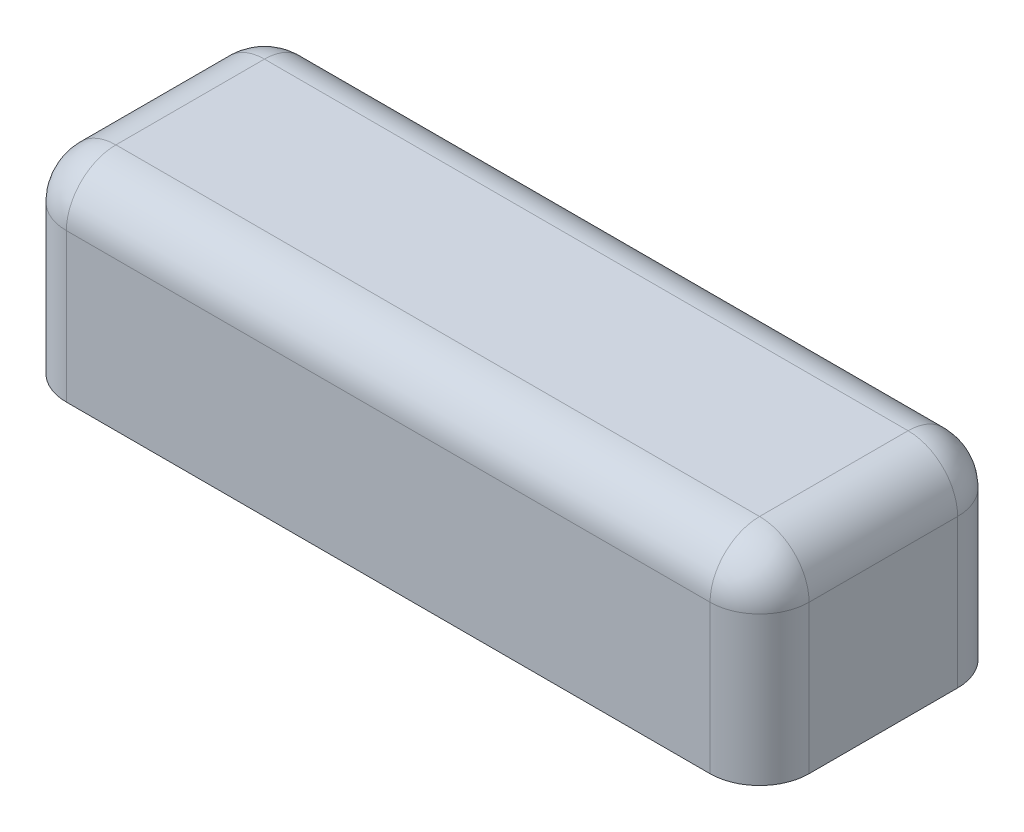
ISO-10303-21;
HEADER;
FILE_DESCRIPTION(('STEP AP214'),'2;1');
FILE_NAME('part.step','',(''),(''),'','','');
FILE_SCHEMA(('AUTOMOTIVE_DESIGN { 1 0 10303 214 1 1 1 1 }'));
ENDSEC;
DATA;
#1=APPLICATION_CONTEXT('core data for automotive mechanical design processes');
#2=APPLICATION_PROTOCOL_DEFINITION('international standard','automotive_design',2000,#1);
#3=PRODUCT_CONTEXT('',#1,'mechanical');
#4=PRODUCT('Part','Part','',(#3));
#5=PRODUCT_RELATED_PRODUCT_CATEGORY('part','',(#4));
#6=PRODUCT_DEFINITION_FORMATION('','',#4);
#7=PRODUCT_DEFINITION_CONTEXT('part definition',#1,'design');
#8=PRODUCT_DEFINITION('design','',#6,#7);
#9=PRODUCT_DEFINITION_SHAPE('','',#8);
#10=(LENGTH_UNIT() NAMED_UNIT(*) SI_UNIT(.MILLI.,.METRE.));
#11=(NAMED_UNIT(*) PLANE_ANGLE_UNIT() SI_UNIT($,.RADIAN.));
#12=(NAMED_UNIT(*) SI_UNIT($,.STERADIAN.) SOLID_ANGLE_UNIT());
#13=UNCERTAINTY_MEASURE_WITH_UNIT(LENGTH_MEASURE(1.E-05),#10,'distance_accuracy_value','');
#14=(GEOMETRIC_REPRESENTATION_CONTEXT(3) GLOBAL_UNCERTAINTY_ASSIGNED_CONTEXT((#13)) GLOBAL_UNIT_ASSIGNED_CONTEXT((#10,
#11,#12)) REPRESENTATION_CONTEXT('',''));
#15=CARTESIAN_POINT('',(0.,0.,0.));
#16=DIRECTION('',(0.,0.,1.));
#17=DIRECTION('',(1.,0.,0.));
#18=AXIS2_PLACEMENT_3D('',#15,#16,#17);
#19=CARTESIAN_POINT('',(19.4027020138142,4.,50.8352955261232));
#20=DIRECTION('',(1.,0.,0.));
#21=DIRECTION('',(0.,0.,-1.));
#22=AXIS2_PLACEMENT_3D('',#19,#20,#21);
#23=PLANE('',#22);
#24=DIRECTION('',(0.,0.,1.));
#25=VECTOR('',#24,1.);
#26=CARTESIAN_POINT('',(19.4027020138142,3.,50.8352955261232));
#27=LINE('',#26,#25);
#28=CARTESIAN_POINT('',(19.4027020138142,3.,49.8352955261232));
#29=VERTEX_POINT('',#28);
#30=CARTESIAN_POINT('',(19.4027020138142,3.,46.8352955261232));
#31=VERTEX_POINT('',#30);
#32=EDGE_CURVE('E54',#29,#31,#27,.F.);
#33=ORIENTED_EDGE('',*,*,#32,.T.);
#34=DIRECTION('',(0.,-1.,0.));
#35=VECTOR('',#34,1.);
#36=CARTESIAN_POINT('',(19.4027020138142,4.,46.8352955261232));
#37=LINE('',#36,#35);
#38=CARTESIAN_POINT('',(19.4027020138142,0.,46.8352955261232));
#39=VERTEX_POINT('',#38);
#40=EDGE_CURVE('E11',#31,#39,#37,.T.);
#41=ORIENTED_EDGE('',*,*,#40,.T.);
#42=DIRECTION('',(0.,0.,1.));
#43=VECTOR('',#42,1.);
#44=CARTESIAN_POINT('',(19.4027020138142,0.,50.8352955261232));
#45=LINE('',#44,#43);
#46=CARTESIAN_POINT('',(19.4027020138142,0.,49.8352955261232));
#47=VERTEX_POINT('',#46);
#48=EDGE_CURVE('E203',#39,#47,#45,.T.);
#49=ORIENTED_EDGE('',*,*,#48,.T.);
#50=DIRECTION('',(0.,-1.,0.));
#51=VECTOR('',#50,1.);
#52=CARTESIAN_POINT('',(19.4027020138142,4.,49.8352955261232));
#53=LINE('',#52,#51);
#54=EDGE_CURVE('E47',#47,#29,#53,.F.);
#55=ORIENTED_EDGE('',*,*,#54,.T.);
#56=EDGE_LOOP('',(#33,#41,#49,#55));
#57=FACE_BOUND('',#56,.T.);
#58=ADVANCED_FACE('F38',(#57),#23,.F.);
#59=CARTESIAN_POINT('',(34.4027020138142,4.,50.8352955261232));
#60=DIRECTION('',(0.,0.,-1.));
#61=DIRECTION('',(-1.,0.,0.));
#62=AXIS2_PLACEMENT_3D('',#59,#60,#61);
#63=PLANE('',#62);
#64=DIRECTION('',(1.,0.,0.));
#65=VECTOR('',#64,1.);
#66=CARTESIAN_POINT('',(34.4027020138142,0.,50.8352955261232));
#67=LINE('',#66,#65);
#68=CARTESIAN_POINT('',(20.4027020138142,0.,50.8352955261232));
#69=VERTEX_POINT('',#68);
#70=CARTESIAN_POINT('',(33.4027020138142,0.,50.8352955261232));
#71=VERTEX_POINT('',#70);
#72=EDGE_CURVE('E205',#69,#71,#67,.T.);
#73=ORIENTED_EDGE('',*,*,#72,.T.);
#74=DIRECTION('',(0.,-1.,0.));
#75=VECTOR('',#74,1.);
#76=CARTESIAN_POINT('',(33.4027020138142,4.,50.8352955261232));
#77=LINE('',#76,#75);
#78=CARTESIAN_POINT('',(33.4027020138142,3.,50.8352955261232));
#79=VERTEX_POINT('',#78);
#80=EDGE_CURVE('E177',#71,#79,#77,.F.);
#81=ORIENTED_EDGE('',*,*,#80,.T.);
#82=DIRECTION('',(1.,0.,0.));
#83=VECTOR('',#82,1.);
#84=CARTESIAN_POINT('',(34.4027020138142,3.,50.8352955261232));
#85=LINE('',#84,#83);
#86=CARTESIAN_POINT('',(20.4027020138142,3.,50.8352955261232));
#87=VERTEX_POINT('',#86);
#88=EDGE_CURVE('E173',#79,#87,#85,.F.);
#89=ORIENTED_EDGE('',*,*,#88,.T.);
#90=DIRECTION('',(0.,-1.,0.));
#91=VECTOR('',#90,1.);
#92=CARTESIAN_POINT('',(20.4027020138142,4.,50.8352955261232));
#93=LINE('',#92,#91);
#94=EDGE_CURVE('E175',#87,#69,#93,.T.);
#95=ORIENTED_EDGE('',*,*,#94,.T.);
#96=EDGE_LOOP('',(#73,#81,#89,#95));
#97=FACE_BOUND('',#96,.T.);
#98=ADVANCED_FACE('F245',(#97),#63,.F.);
#99=CARTESIAN_POINT('',(34.4027020138142,4.,45.8352955261232));
#100=DIRECTION('',(-1.,0.,0.));
#101=DIRECTION('',(0.,0.,1.));
#102=AXIS2_PLACEMENT_3D('',#99,#100,#101);
#103=PLANE('',#102);
#104=DIRECTION('',(0.,0.,-1.));
#105=VECTOR('',#104,1.);
#106=CARTESIAN_POINT('',(34.4027020138142,0.,45.8352955261232));
#107=LINE('',#106,#105);
#108=CARTESIAN_POINT('',(34.4027020138142,0.,49.8352955261232));
#109=VERTEX_POINT('',#108);
#110=CARTESIAN_POINT('',(34.4027020138142,0.,46.8352955261232));
#111=VERTEX_POINT('',#110);
#112=EDGE_CURVE('E209',#109,#111,#107,.T.);
#113=ORIENTED_EDGE('',*,*,#112,.T.);
#114=DIRECTION('',(0.,-1.,0.));
#115=VECTOR('',#114,1.);
#116=CARTESIAN_POINT('',(34.4027020138142,4.,46.8352955261232));
#117=LINE('',#116,#115);
#118=CARTESIAN_POINT('',(34.4027020138142,3.,46.8352955261232));
#119=VERTEX_POINT('',#118);
#120=EDGE_CURVE('E157',#111,#119,#117,.F.);
#121=ORIENTED_EDGE('',*,*,#120,.T.);
#122=DIRECTION('',(0.,0.,-1.));
#123=VECTOR('',#122,1.);
#124=CARTESIAN_POINT('',(34.4027020138142,3.,45.8352955261232));
#125=LINE('',#124,#123);
#126=CARTESIAN_POINT('',(34.4027020138142,3.,49.8352955261232));
#127=VERTEX_POINT('',#126);
#128=EDGE_CURVE('E121',#119,#127,#125,.F.);
#129=ORIENTED_EDGE('',*,*,#128,.T.);
#130=DIRECTION('',(0.,-1.,0.));
#131=VECTOR('',#130,1.);
#132=CARTESIAN_POINT('',(34.4027020138142,4.,49.8352955261232));
#133=LINE('',#132,#131);
#134=EDGE_CURVE('E151',#127,#109,#133,.T.);
#135=ORIENTED_EDGE('',*,*,#134,.T.);
#136=EDGE_LOOP('',(#113,#121,#129,#135));
#137=FACE_BOUND('',#136,.T.);
#138=ADVANCED_FACE('F236',(#137),#103,.F.);
#139=CARTESIAN_POINT('',(19.4027020138142,4.,45.8352955261232));
#140=DIRECTION('',(0.,0.,1.));
#141=DIRECTION('',(1.,0.,0.));
#142=AXIS2_PLACEMENT_3D('',#139,#140,#141);
#143=PLANE('',#142);
#144=DIRECTION('',(-1.,0.,0.));
#145=VECTOR('',#144,1.);
#146=CARTESIAN_POINT('',(19.4027020138142,3.,45.8352955261232));
#147=LINE('',#146,#145);
#148=CARTESIAN_POINT('',(20.4027020138142,3.,45.8352955261232));
#149=VERTEX_POINT('',#148);
#150=CARTESIAN_POINT('',(33.4027020138142,3.,45.8352955261232));
#151=VERTEX_POINT('',#150);
#152=EDGE_CURVE('E159',#149,#151,#147,.F.);
#153=ORIENTED_EDGE('',*,*,#152,.T.);
#154=DIRECTION('',(0.,-1.,0.));
#155=VECTOR('',#154,1.);
#156=CARTESIAN_POINT('',(33.4027020138142,4.,45.8352955261232));
#157=LINE('',#156,#155);
#158=CARTESIAN_POINT('',(33.4027020138142,0.,45.8352955261232));
#159=VERTEX_POINT('',#158);
#160=EDGE_CURVE('E163',#151,#159,#157,.T.);
#161=ORIENTED_EDGE('',*,*,#160,.T.);
#162=DIRECTION('',(-1.,0.,0.));
#163=VECTOR('',#162,1.);
#164=CARTESIAN_POINT('',(19.4027020138142,0.,45.8352955261232));
#165=LINE('',#164,#163);
#166=CARTESIAN_POINT('',(20.4027020138142,0.,45.8352955261232));
#167=VERTEX_POINT('',#166);
#168=EDGE_CURVE('E144',#159,#167,#165,.T.);
#169=ORIENTED_EDGE('',*,*,#168,.T.);
#170=DIRECTION('',(0.,-1.,0.));
#171=VECTOR('',#170,1.);
#172=CARTESIAN_POINT('',(20.4027020138142,4.,45.8352955261232));
#173=LINE('',#172,#171);
#174=EDGE_CURVE('E161',#167,#149,#173,.F.);
#175=ORIENTED_EDGE('',*,*,#174,.T.);
#176=EDGE_LOOP('',(#153,#161,#169,#175));
#177=FACE_BOUND('',#176,.T.);
#178=ADVANCED_FACE('F218',(#177),#143,.F.);
#179=CARTESIAN_POINT('',(0.,4.,0.));
#180=DIRECTION('',(0.,-1.,0.));
#181=DIRECTION('',(0.,0.,-1.));
#182=AXIS2_PLACEMENT_3D('',#179,#180,#181);
#183=PLANE('',#182);
#184=DIRECTION('',(0.,0.,1.));
#185=VECTOR('',#184,1.);
#186=CARTESIAN_POINT('',(20.4027020138142,4.,0.));
#187=LINE('',#186,#185);
#188=CARTESIAN_POINT('',(20.4027020138142,4.,46.8352955261232));
#189=VERTEX_POINT('',#188);
#190=CARTESIAN_POINT('',(20.4027020138142,4.,49.8352955261232));
#191=VERTEX_POINT('',#190);
#192=EDGE_CURVE('E143',#189,#191,#187,.T.);
#193=ORIENTED_EDGE('',*,*,#192,.T.);
#194=DIRECTION('',(1.,0.,0.));
#195=VECTOR('',#194,1.);
#196=CARTESIAN_POINT('',(0.,4.,49.8352955261232));
#197=LINE('',#196,#195);
#198=CARTESIAN_POINT('',(33.4027020138142,4.,49.8352955261232));
#199=VERTEX_POINT('',#198);
#200=EDGE_CURVE('E148',#191,#199,#197,.T.);
#201=ORIENTED_EDGE('',*,*,#200,.T.);
#202=DIRECTION('',(0.,0.,-1.));
#203=VECTOR('',#202,1.);
#204=CARTESIAN_POINT('',(33.4027020138142,4.,0.));
#205=LINE('',#204,#203);
#206=CARTESIAN_POINT('',(33.4027020138142,4.,46.8352955261232));
#207=VERTEX_POINT('',#206);
#208=EDGE_CURVE('E119',#199,#207,#205,.T.);
#209=ORIENTED_EDGE('',*,*,#208,.T.);
#210=DIRECTION('',(-1.,0.,0.));
#211=VECTOR('',#210,1.);
#212=CARTESIAN_POINT('',(0.,4.,46.8352955261232));
#213=LINE('',#212,#211);
#214=EDGE_CURVE('E137',#207,#189,#213,.T.);
#215=ORIENTED_EDGE('',*,*,#214,.T.);
#216=EDGE_LOOP('',(#193,#201,#209,#215));
#217=FACE_BOUND('',#216,.T.);
#218=ADVANCED_FACE('F146',(#217),#183,.F.);
#219=CARTESIAN_POINT('',(0.,0.,0.));
#220=DIRECTION('',(0.,-1.,0.));
#221=DIRECTION('',(0.,0.,-1.));
#222=AXIS2_PLACEMENT_3D('',#219,#220,#221);
#223=PLANE('',#222);
#224=ORIENTED_EDGE('',*,*,#168,.F.);
#225=CARTESIAN_POINT('',(33.4027020138142,0.,46.8352955261232));
#226=DIRECTION('',(0.,-1.,0.));
#227=DIRECTION('',(0.,0.,-1.));
#228=AXIS2_PLACEMENT_3D('',#225,#226,#227);
#229=CIRCLE('',#228,1.);
#230=EDGE_CURVE('E171',#159,#111,#229,.T.);
#231=ORIENTED_EDGE('',*,*,#230,.T.);
#232=ORIENTED_EDGE('',*,*,#112,.F.);
#233=CARTESIAN_POINT('',(33.4027020138142,0.,49.8352955261232));
#234=DIRECTION('',(0.,-1.,0.));
#235=DIRECTION('',(0.,0.,-1.));
#236=AXIS2_PLACEMENT_3D('',#233,#234,#235);
#237=CIRCLE('',#236,1.);
#238=EDGE_CURVE('E169',#109,#71,#237,.T.);
#239=ORIENTED_EDGE('',*,*,#238,.T.);
#240=ORIENTED_EDGE('',*,*,#72,.F.);
#241=CARTESIAN_POINT('',(20.4027020138142,0.,49.8352955261232));
#242=DIRECTION('',(0.,-1.,0.));
#243=DIRECTION('',(0.,0.,-1.));
#244=AXIS2_PLACEMENT_3D('',#241,#242,#243);
#245=CIRCLE('',#244,1.);
#246=EDGE_CURVE('E165',#69,#47,#245,.T.);
#247=ORIENTED_EDGE('',*,*,#246,.T.);
#248=ORIENTED_EDGE('',*,*,#48,.F.);
#249=CARTESIAN_POINT('',(20.4027020138142,0.,46.8352955261232));
#250=DIRECTION('',(0.,-1.,0.));
#251=DIRECTION('',(0.,0.,-1.));
#252=AXIS2_PLACEMENT_3D('',#249,#250,#251);
#253=CIRCLE('',#252,1.);
#254=EDGE_CURVE('E167',#39,#167,#253,.T.);
#255=ORIENTED_EDGE('',*,*,#254,.T.);
#256=EDGE_LOOP('',(#224,#231,#232,#239,#240,#247,#248,#255));
#257=FACE_BOUND('',#256,.T.);
#258=ADVANCED_FACE('F233',(#257),#223,.T.);
#259=CARTESIAN_POINT('',(20.4027020138142,4.,49.8352955261232));
#260=DIRECTION('',(0.,-1.,0.));
#261=DIRECTION('',(0.,0.,-1.));
#262=AXIS2_PLACEMENT_3D('',#259,#260,#261);
#263=CYLINDRICAL_SURFACE('',#262,1.);
#264=ORIENTED_EDGE('',*,*,#246,.F.);
#265=ORIENTED_EDGE('',*,*,#94,.F.);
#266=CARTESIAN_POINT('',(20.4027020138142,3.,49.8352955261232));
#267=DIRECTION('',(0.,1.,0.));
#268=DIRECTION('',(0.,0.,1.));
#269=AXIS2_PLACEMENT_3D('',#266,#267,#268);
#270=CIRCLE('',#269,1.);
#271=EDGE_CURVE('E42',#29,#87,#270,.T.);
#272=ORIENTED_EDGE('',*,*,#271,.F.);
#273=ORIENTED_EDGE('',*,*,#54,.F.);
#274=EDGE_LOOP('',(#264,#265,#272,#273));
#275=FACE_BOUND('',#274,.T.);
#276=ADVANCED_FACE('F40',(#275),#263,.T.);
#277=CARTESIAN_POINT('',(20.4027020138142,3.,0.));
#278=DIRECTION('',(0.,0.,1.));
#279=DIRECTION('',(1.,0.,0.));
#280=AXIS2_PLACEMENT_3D('',#277,#278,#279);
#281=CYLINDRICAL_SURFACE('',#280,1.);
#282=CARTESIAN_POINT('',(20.4027020138142,3.,46.8352955261232));
#283=DIRECTION('',(0.,0.,-1.));
#284=DIRECTION('',(-1.,0.,0.));
#285=AXIS2_PLACEMENT_3D('',#282,#283,#284);
#286=CIRCLE('',#285,1.);
#287=EDGE_CURVE('E195',#31,#189,#286,.T.);
#288=ORIENTED_EDGE('',*,*,#287,.F.);
#289=ORIENTED_EDGE('',*,*,#32,.F.);
#290=CARTESIAN_POINT('',(20.4027020138142,3.,49.8352955261232));
#291=DIRECTION('',(0.,0.,1.));
#292=DIRECTION('',(1.,0.,0.));
#293=AXIS2_PLACEMENT_3D('',#290,#291,#292);
#294=CIRCLE('',#293,1.);
#295=EDGE_CURVE('E197',#191,#29,#294,.T.);
#296=ORIENTED_EDGE('',*,*,#295,.F.);
#297=ORIENTED_EDGE('',*,*,#192,.F.);
#298=EDGE_LOOP('',(#288,#289,#296,#297));
#299=FACE_BOUND('',#298,.T.);
#300=ADVANCED_FACE('F250',(#299),#281,.T.);
#301=CARTESIAN_POINT('',(20.4027020138142,4.,46.8352955261232));
#302=DIRECTION('',(0.,-1.,0.));
#303=DIRECTION('',(0.,0.,-1.));
#304=AXIS2_PLACEMENT_3D('',#301,#302,#303);
#305=CYLINDRICAL_SURFACE('',#304,1.);
#306=ORIENTED_EDGE('',*,*,#254,.F.);
#307=ORIENTED_EDGE('',*,*,#40,.F.);
#308=CARTESIAN_POINT('',(20.4027020138142,3.,46.8352955261232));
#309=DIRECTION('',(0.,1.,0.));
#310=DIRECTION('',(0.,0.,1.));
#311=AXIS2_PLACEMENT_3D('',#308,#309,#310);
#312=CIRCLE('',#311,1.);
#313=EDGE_CURVE('E192',#149,#31,#312,.T.);
#314=ORIENTED_EDGE('',*,*,#313,.F.);
#315=ORIENTED_EDGE('',*,*,#174,.F.);
#316=EDGE_LOOP('',(#306,#307,#314,#315));
#317=FACE_BOUND('',#316,.T.);
#318=ADVANCED_FACE('F225',(#317),#305,.T.);
#319=CARTESIAN_POINT('',(20.4027020138142,3.,49.8352955261232));
#320=DIRECTION('',(0.,0.,1.));
#321=DIRECTION('',(1.,0.,0.));
#322=AXIS2_PLACEMENT_3D('',#319,#320,#321);
#323=SPHERICAL_SURFACE('',#322,1.);
#324=ORIENTED_EDGE('',*,*,#295,.T.);
#325=ORIENTED_EDGE('',*,*,#271,.T.);
#326=CARTESIAN_POINT('',(20.4027020138142,3.,49.8352955261232));
#327=DIRECTION('',(-1.,0.,0.));
#328=DIRECTION('',(0.,0.,1.));
#329=AXIS2_PLACEMENT_3D('',#326,#327,#328);
#330=CIRCLE('',#329,1.);
#331=EDGE_CURVE('E189',#191,#87,#330,.F.);
#332=ORIENTED_EDGE('',*,*,#331,.F.);
#333=EDGE_LOOP('',(#324,#325,#332));
#334=FACE_BOUND('',#333,.T.);
#335=ADVANCED_FACE('F283',(#334),#323,.T.);
#336=CARTESIAN_POINT('',(20.4027020138142,3.,46.8352955261232));
#337=DIRECTION('',(0.,0.,1.));
#338=DIRECTION('',(1.,0.,0.));
#339=AXIS2_PLACEMENT_3D('',#336,#337,#338);
#340=SPHERICAL_SURFACE('',#339,1.);
#341=ORIENTED_EDGE('',*,*,#313,.T.);
#342=ORIENTED_EDGE('',*,*,#287,.T.);
#343=CARTESIAN_POINT('',(20.4027020138142,3.,46.8352955261232));
#344=DIRECTION('',(-1.,0.,0.));
#345=DIRECTION('',(0.,0.,1.));
#346=AXIS2_PLACEMENT_3D('',#343,#344,#345);
#347=CIRCLE('',#346,1.);
#348=EDGE_CURVE('E140',#149,#189,#347,.F.);
#349=ORIENTED_EDGE('',*,*,#348,.F.);
#350=EDGE_LOOP('',(#341,#342,#349));
#351=FACE_BOUND('',#350,.T.);
#352=ADVANCED_FACE('F228',(#351),#340,.T.);
#353=CARTESIAN_POINT('',(33.4027020138142,4.,49.8352955261232));
#354=DIRECTION('',(0.,-1.,0.));
#355=DIRECTION('',(0.,0.,-1.));
#356=AXIS2_PLACEMENT_3D('',#353,#354,#355);
#357=CYLINDRICAL_SURFACE('',#356,1.);
#358=ORIENTED_EDGE('',*,*,#238,.F.);
#359=ORIENTED_EDGE('',*,*,#134,.F.);
#360=CARTESIAN_POINT('',(33.4027020138142,3.,49.8352955261232));
#361=DIRECTION('',(0.,1.,0.));
#362=DIRECTION('',(0.,0.,1.));
#363=AXIS2_PLACEMENT_3D('',#360,#361,#362);
#364=CIRCLE('',#363,1.);
#365=EDGE_CURVE('E185',#79,#127,#364,.T.);
#366=ORIENTED_EDGE('',*,*,#365,.F.);
#367=ORIENTED_EDGE('',*,*,#80,.F.);
#368=EDGE_LOOP('',(#358,#359,#366,#367));
#369=FACE_BOUND('',#368,.T.);
#370=ADVANCED_FACE('F240',(#369),#357,.T.);
#371=CARTESIAN_POINT('',(0.,3.,49.8352955261232));
#372=DIRECTION('',(1.,0.,0.));
#373=DIRECTION('',(0.,0.,-1.));
#374=AXIS2_PLACEMENT_3D('',#371,#372,#373);
#375=CYLINDRICAL_SURFACE('',#374,1.);
#376=ORIENTED_EDGE('',*,*,#331,.T.);
#377=ORIENTED_EDGE('',*,*,#88,.F.);
#378=CARTESIAN_POINT('',(33.4027020138142,3.,49.8352955261232));
#379=DIRECTION('',(1.,0.,0.));
#380=DIRECTION('',(0.,0.,-1.));
#381=AXIS2_PLACEMENT_3D('',#378,#379,#380);
#382=CIRCLE('',#381,1.);
#383=EDGE_CURVE('E134',#199,#79,#382,.T.);
#384=ORIENTED_EDGE('',*,*,#383,.F.);
#385=ORIENTED_EDGE('',*,*,#200,.F.);
#386=EDGE_LOOP('',(#376,#377,#384,#385));
#387=FACE_BOUND('',#386,.T.);
#388=ADVANCED_FACE('F275',(#387),#375,.T.);
#389=CARTESIAN_POINT('',(0.,3.,46.8352955261232));
#390=DIRECTION('',(-1.,0.,0.));
#391=DIRECTION('',(0.,0.,1.));
#392=AXIS2_PLACEMENT_3D('',#389,#390,#391);
#393=CYLINDRICAL_SURFACE('',#392,1.);
#394=ORIENTED_EDGE('',*,*,#348,.T.);
#395=ORIENTED_EDGE('',*,*,#214,.F.);
#396=CARTESIAN_POINT('',(33.4027020138142,3.,46.8352955261232));
#397=DIRECTION('',(1.,0.,0.));
#398=DIRECTION('',(0.,0.,-1.));
#399=AXIS2_PLACEMENT_3D('',#396,#397,#398);
#400=CIRCLE('',#399,1.);
#401=EDGE_CURVE('E127',#151,#207,#400,.T.);
#402=ORIENTED_EDGE('',*,*,#401,.F.);
#403=ORIENTED_EDGE('',*,*,#152,.F.);
#404=EDGE_LOOP('',(#394,#395,#402,#403));
#405=FACE_BOUND('',#404,.T.);
#406=ADVANCED_FACE('F138',(#405),#393,.T.);
#407=CARTESIAN_POINT('',(33.4027020138142,4.,46.8352955261232));
#408=DIRECTION('',(0.,-1.,0.));
#409=DIRECTION('',(0.,0.,-1.));
#410=AXIS2_PLACEMENT_3D('',#407,#408,#409);
#411=CYLINDRICAL_SURFACE('',#410,1.);
#412=ORIENTED_EDGE('',*,*,#230,.F.);
#413=ORIENTED_EDGE('',*,*,#160,.F.);
#414=CARTESIAN_POINT('',(33.4027020138142,3.,46.8352955261232));
#415=DIRECTION('',(0.,1.,0.));
#416=DIRECTION('',(0.,0.,1.));
#417=AXIS2_PLACEMENT_3D('',#414,#415,#416);
#418=CIRCLE('',#417,1.);
#419=EDGE_CURVE('E131',#119,#151,#418,.T.);
#420=ORIENTED_EDGE('',*,*,#419,.F.);
#421=ORIENTED_EDGE('',*,*,#120,.F.);
#422=EDGE_LOOP('',(#412,#413,#420,#421));
#423=FACE_BOUND('',#422,.T.);
#424=ADVANCED_FACE('F230',(#423),#411,.T.);
#425=CARTESIAN_POINT('',(33.4027020138142,3.,49.8352955261232));
#426=DIRECTION('',(0.,0.,1.));
#427=DIRECTION('',(1.,0.,0.));
#428=AXIS2_PLACEMENT_3D('',#425,#426,#427);
#429=SPHERICAL_SURFACE('',#428,1.);
#430=ORIENTED_EDGE('',*,*,#383,.T.);
#431=ORIENTED_EDGE('',*,*,#365,.T.);
#432=CARTESIAN_POINT('',(33.4027020138142,3.,49.8352955261232));
#433=DIRECTION('',(0.,0.,1.));
#434=DIRECTION('',(1.,0.,0.));
#435=AXIS2_PLACEMENT_3D('',#432,#433,#434);
#436=CIRCLE('',#435,1.);
#437=EDGE_CURVE('E124',#199,#127,#436,.F.);
#438=ORIENTED_EDGE('',*,*,#437,.F.);
#439=EDGE_LOOP('',(#430,#431,#438));
#440=FACE_BOUND('',#439,.T.);
#441=ADVANCED_FACE('F267',(#440),#429,.T.);
#442=CARTESIAN_POINT('',(33.4027020138142,3.,46.8352955261232));
#443=DIRECTION('',(0.,0.,1.));
#444=DIRECTION('',(1.,0.,0.));
#445=AXIS2_PLACEMENT_3D('',#442,#443,#444);
#446=SPHERICAL_SURFACE('',#445,1.);
#447=ORIENTED_EDGE('',*,*,#419,.T.);
#448=ORIENTED_EDGE('',*,*,#401,.T.);
#449=CARTESIAN_POINT('',(33.4027020138142,3.,46.8352955261232));
#450=DIRECTION('',(0.,0.,-1.));
#451=DIRECTION('',(-1.,0.,0.));
#452=AXIS2_PLACEMENT_3D('',#449,#450,#451);
#453=CIRCLE('',#452,1.);
#454=EDGE_CURVE('E115',#119,#207,#453,.F.);
#455=ORIENTED_EDGE('',*,*,#454,.F.);
#456=EDGE_LOOP('',(#447,#448,#455));
#457=FACE_BOUND('',#456,.T.);
#458=ADVANCED_FACE('F129',(#457),#446,.T.);
#459=CARTESIAN_POINT('',(33.4027020138142,3.,0.));
#460=DIRECTION('',(0.,0.,-1.));
#461=DIRECTION('',(-1.,0.,0.));
#462=AXIS2_PLACEMENT_3D('',#459,#460,#461);
#463=CYLINDRICAL_SURFACE('',#462,1.);
#464=ORIENTED_EDGE('',*,*,#437,.T.);
#465=ORIENTED_EDGE('',*,*,#128,.F.);
#466=ORIENTED_EDGE('',*,*,#454,.T.);
#467=ORIENTED_EDGE('',*,*,#208,.F.);
#468=EDGE_LOOP('',(#464,#465,#466,#467));
#469=FACE_BOUND('',#468,.T.);
#470=ADVANCED_FACE('F117',(#469),#463,.T.);
#471=CLOSED_SHELL('',(#58,#98,#138,#178,#218,#258,#276,#300,#318,#335,#352,#370,#388,#406,#424,
#441,#458,#470));
#472=MANIFOLD_SOLID_BREP('B2',#471);
#473=ADVANCED_BREP_SHAPE_REPRESENTATION('',(#18,#472),#14);
#474=SHAPE_DEFINITION_REPRESENTATION(#9,#473);
ENDSEC;
END-ISO-10303-21;
